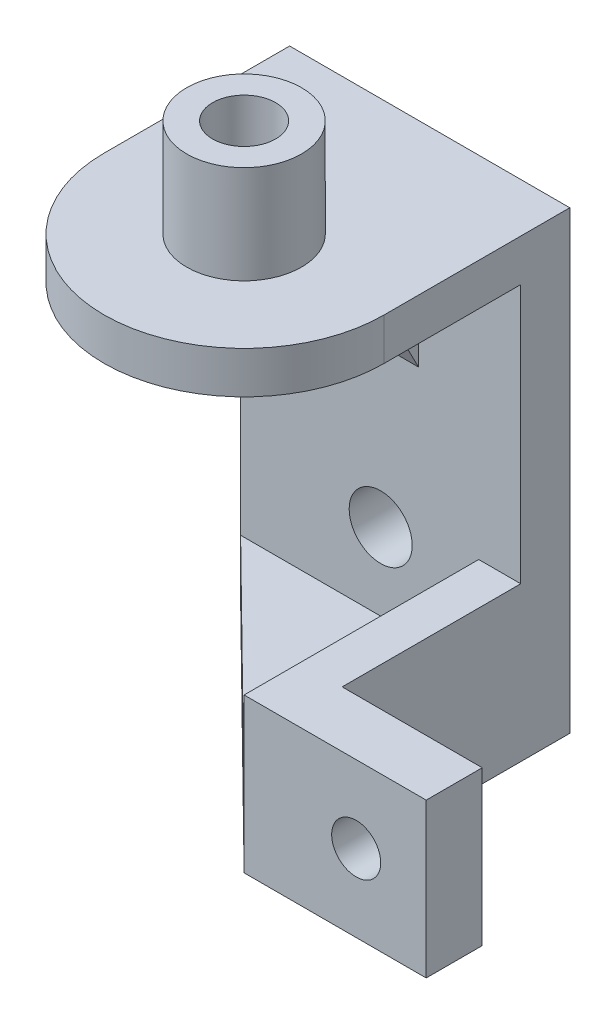
ISO-10303-21;
HEADER;
FILE_DESCRIPTION(('STEP AP214'),'2;1');
FILE_NAME('part.step','',(''),(''),'','','');
FILE_SCHEMA(('AUTOMOTIVE_DESIGN { 1 0 10303 214 1 1 1 1 }'));
ENDSEC;
DATA;
#1=APPLICATION_CONTEXT('core data for automotive mechanical design processes');
#2=APPLICATION_PROTOCOL_DEFINITION('international standard','automotive_design',2000,#1);
#3=PRODUCT_CONTEXT('',#1,'mechanical');
#4=PRODUCT('Part','Part','',(#3));
#5=PRODUCT_RELATED_PRODUCT_CATEGORY('part','',(#4));
#6=PRODUCT_DEFINITION_FORMATION('','',#4);
#7=PRODUCT_DEFINITION_CONTEXT('part definition',#1,'design');
#8=PRODUCT_DEFINITION('design','',#6,#7);
#9=PRODUCT_DEFINITION_SHAPE('','',#8);
#10=(LENGTH_UNIT() NAMED_UNIT(*) SI_UNIT(.MILLI.,.METRE.));
#11=(NAMED_UNIT(*) PLANE_ANGLE_UNIT() SI_UNIT($,.RADIAN.));
#12=(NAMED_UNIT(*) SI_UNIT($,.STERADIAN.) SOLID_ANGLE_UNIT());
#13=UNCERTAINTY_MEASURE_WITH_UNIT(LENGTH_MEASURE(1.E-05),#10,'distance_accuracy_value','');
#14=(GEOMETRIC_REPRESENTATION_CONTEXT(3) GLOBAL_UNCERTAINTY_ASSIGNED_CONTEXT((#13)) GLOBAL_UNIT_ASSIGNED_CONTEXT((#10,
#11,#12)) REPRESENTATION_CONTEXT('',''));
#15=CARTESIAN_POINT('',(0.,0.,0.));
#16=DIRECTION('',(0.,0.,1.));
#17=DIRECTION('',(1.,0.,0.));
#18=AXIS2_PLACEMENT_3D('',#15,#16,#17);
#19=CARTESIAN_POINT('',(1.28402573287201,-48.,-15.9459750219353));
#20=DIRECTION('',(0.,0.,-1.));
#21=DIRECTION('',(-1.,0.,0.));
#22=AXIS2_PLACEMENT_3D('',#19,#20,#21);
#23=PLANE('',#22);
#24=CARTESIAN_POINT('',(-8.71597426712799,-43.,-15.9459750219353));
#25=DIRECTION('',(0.,0.,1.));
#26=DIRECTION('',(-1.,0.,0.));
#27=AXIS2_PLACEMENT_3D('',#24,#25,#26);
#28=CIRCLE('',#27,2.25);
#29=CARTESIAN_POINT('',(-10.965974267128,-43.,-15.9459750219353));
#30=VERTEX_POINT('',#29);
#31=EDGE_CURVE('E303',#30,#30,#28,.T.);
#32=ORIENTED_EDGE('',*,*,#31,.F.);
#33=EDGE_LOOP('',(#32));
#34=FACE_BOUND('',#33,.T.);
#35=DIRECTION('',(1.,0.,0.));
#36=VECTOR('',#35,1.);
#37=CARTESIAN_POINT('',(1.28402573287201,-48.5,-15.9459750219353));
#38=LINE('',#37,#36);
#39=CARTESIAN_POINT('',(-18.715974267128,-48.5,-15.9459750219353));
#40=VERTEX_POINT('',#39);
#41=CARTESIAN_POINT('',(-1.71597426712799,-48.5,-15.9459750219353));
#42=VERTEX_POINT('',#41);
#43=EDGE_CURVE('E193',#40,#42,#38,.T.);
#44=ORIENTED_EDGE('',*,*,#43,.T.);
#45=DIRECTION('',(0.,1.,0.));
#46=VECTOR('',#45,1.);
#47=CARTESIAN_POINT('',(-1.71597426712799,-52.5,-15.9459750219353));
#48=LINE('',#47,#46);
#49=CARTESIAN_POINT('',(-1.71597426712799,-41.5,-15.9459750219353));
#50=VERTEX_POINT('',#49);
#51=EDGE_CURVE('E237',#42,#50,#48,.T.);
#52=ORIENTED_EDGE('',*,*,#51,.T.);
#53=DIRECTION('',(1.,0.,0.));
#54=VECTOR('',#53,1.);
#55=CARTESIAN_POINT('',(1.28402573287201,-41.5,-15.9459750219353));
#56=LINE('',#55,#54);
#57=CARTESIAN_POINT('',(1.28402573287201,-41.5,-15.9459750219353));
#58=VERTEX_POINT('',#57);
#59=EDGE_CURVE('E243',#50,#58,#56,.T.);
#60=ORIENTED_EDGE('',*,*,#59,.T.);
#61=DIRECTION('',(0.,1.,0.));
#62=VECTOR('',#61,1.);
#63=CARTESIAN_POINT('',(1.28402573287201,-48.,-15.9459750219353));
#64=LINE('',#63,#62);
#65=CARTESIAN_POINT('',(1.28402573287201,-23.,-15.9459750219353));
#66=VERTEX_POINT('',#65);
#67=EDGE_CURVE('E198',#58,#66,#64,.T.);
#68=ORIENTED_EDGE('',*,*,#67,.T.);
#69=DIRECTION('',(1.,0.,0.));
#70=VECTOR('',#69,1.);
#71=CARTESIAN_POINT('',(1.28402573287201,-23.,-15.9459750219353));
#72=LINE('',#71,#70);
#73=CARTESIAN_POINT('',(-6.01597426712799,-23.,-15.9459750219353));
#74=VERTEX_POINT('',#73);
#75=EDGE_CURVE('E312',#74,#66,#72,.T.);
#76=ORIENTED_EDGE('',*,*,#75,.F.);
#77=DIRECTION('',(0.,-1.,0.));
#78=VECTOR('',#77,1.);
#79=CARTESIAN_POINT('',(-6.01597426712799,-48.,-15.9459750219353));
#80=LINE('',#79,#78);
#81=CARTESIAN_POINT('',(-6.01597426712799,-31.75,-15.9459750219353));
#82=VERTEX_POINT('',#81);
#83=EDGE_CURVE('E273',#74,#82,#80,.T.);
#84=ORIENTED_EDGE('',*,*,#83,.T.);
#85=DIRECTION('',(-1.,0.,0.));
#86=VECTOR('',#85,1.);
#87=CARTESIAN_POINT('',(1.28402573287201,-31.75,-15.9459750219353));
#88=LINE('',#87,#86);
#89=CARTESIAN_POINT('',(-11.415974267128,-31.75,-15.9459750219353));
#90=VERTEX_POINT('',#89);
#91=EDGE_CURVE('E291',#90,#82,#88,.F.);
#92=ORIENTED_EDGE('',*,*,#91,.F.);
#93=DIRECTION('',(0.,-1.,0.));
#94=VECTOR('',#93,1.);
#95=CARTESIAN_POINT('',(-11.415974267128,-48.,-15.9459750219353));
#96=LINE('',#95,#94);
#97=CARTESIAN_POINT('',(-11.415974267128,-23.,-15.9459750219353));
#98=VERTEX_POINT('',#97);
#99=EDGE_CURVE('E283',#98,#90,#96,.T.);
#100=ORIENTED_EDGE('',*,*,#99,.F.);
#101=CARTESIAN_POINT('',(-18.715974267128,-23.,-15.9459750219353));
#102=VERTEX_POINT('',#101);
#103=EDGE_CURVE('E196',#102,#98,#72,.T.);
#104=ORIENTED_EDGE('',*,*,#103,.F.);
#105=DIRECTION('',(0.,1.,0.));
#106=VECTOR('',#105,1.);
#107=CARTESIAN_POINT('',(-18.715974267128,-48.,-15.9459750219353));
#108=LINE('',#107,#106);
#109=EDGE_CURVE('E183',#40,#102,#108,.T.);
#110=ORIENTED_EDGE('',*,*,#109,.F.);
#111=EDGE_LOOP('',(#44,#52,#60,#68,#76,#84,#92,#100,#104,#110));
#112=FACE_BOUND('',#111,.T.);
#113=ADVANCED_FACE('F57',(#34,#112),#23,.F.);
#114=CARTESIAN_POINT('',(-1.71597426712799,-52.5,0.804024978064668));
#115=DIRECTION('',(1.,0.,0.));
#116=DIRECTION('',(0.,-1.,0.));
#117=AXIS2_PLACEMENT_3D('',#114,#115,#116);
#118=PLANE('',#117);
#119=DIRECTION('',(0.,0.,1.));
#120=VECTOR('',#119,1.);
#121=CARTESIAN_POINT('',(-1.71597426712799,-48.5,0.804024978064668));
#122=LINE('',#121,#120);
#123=CARTESIAN_POINT('',(-1.71597426712799,-48.5,0.804024978064668));
#124=VERTEX_POINT('',#123);
#125=EDGE_CURVE('E201',#42,#124,#122,.T.);
#126=ORIENTED_EDGE('',*,*,#125,.T.);
#127=DIRECTION('',(0.,1.,0.));
#128=VECTOR('',#127,1.);
#129=CARTESIAN_POINT('',(-1.71597426712799,-52.5,0.804024978064668));
#130=LINE('',#129,#128);
#131=CARTESIAN_POINT('',(-1.71597426712799,-41.5,0.804024978064668));
#132=VERTEX_POINT('',#131);
#133=EDGE_CURVE('E242',#124,#132,#130,.T.);
#134=ORIENTED_EDGE('',*,*,#133,.T.);
#135=DIRECTION('',(0.,0.,-1.));
#136=VECTOR('',#135,1.);
#137=CARTESIAN_POINT('',(-1.71597426712799,-41.5,0.804024978064668));
#138=LINE('',#137,#136);
#139=EDGE_CURVE('E83',#132,#50,#138,.T.);
#140=ORIENTED_EDGE('',*,*,#139,.T.);
#141=ORIENTED_EDGE('',*,*,#51,.F.);
#142=EDGE_LOOP('',(#126,#134,#140,#141));
#143=FACE_BOUND('',#142,.T.);
#144=ADVANCED_FACE('F365',(#143),#118,.F.);
#145=CARTESIAN_POINT('',(1.28402573287201,-23.,0.));
#146=DIRECTION('',(1.,0.,0.));
#147=DIRECTION('',(0.,0.,-1.));
#148=AXIS2_PLACEMENT_3D('',#145,#146,#147);
#149=PLANE('',#148);
#150=DIRECTION('',(0.,0.,1.));
#151=VECTOR('',#150,1.);
#152=CARTESIAN_POINT('',(1.28402573287201,-52.5,-19.4459750219353));
#153=LINE('',#152,#151);
#154=CARTESIAN_POINT('',(1.28402573287201,-52.5,-19.4459750219353));
#155=VERTEX_POINT('',#154);
#156=CARTESIAN_POINT('',(1.28402573287201,-52.5,-3.19597502193533));
#157=VERTEX_POINT('',#156);
#158=EDGE_CURVE('E263',#155,#157,#153,.T.);
#159=ORIENTED_EDGE('',*,*,#158,.F.);
#160=DIRECTION('',(0.,1.,0.));
#161=VECTOR('',#160,1.);
#162=CARTESIAN_POINT('',(1.28402573287201,-23.,-19.4459750219353));
#163=LINE('',#162,#161);
#164=CARTESIAN_POINT('',(1.28402573287201,-20.,-19.4459750219353));
#165=VERTEX_POINT('',#164);
#166=EDGE_CURVE('E349',#155,#165,#163,.T.);
#167=ORIENTED_EDGE('',*,*,#166,.T.);
#168=DIRECTION('',(0.,0.,1.));
#169=VECTOR('',#168,1.);
#170=CARTESIAN_POINT('',(1.28402573287201,-20.,0.));
#171=LINE('',#170,#169);
#172=CARTESIAN_POINT('',(1.28402573287201,-20.,-6.19597502193533));
#173=VERTEX_POINT('',#172);
#174=EDGE_CURVE('E341',#165,#173,#171,.T.);
#175=ORIENTED_EDGE('',*,*,#174,.T.);
#176=DIRECTION('',(0.,1.,0.));
#177=VECTOR('',#176,1.);
#178=CARTESIAN_POINT('',(1.28402573287201,-23.,-6.19597502193533));
#179=LINE('',#178,#177);
#180=CARTESIAN_POINT('',(1.28402573287201,-23.,-6.19597502193533));
#181=VERTEX_POINT('',#180);
#182=EDGE_CURVE('E353',#181,#173,#179,.T.);
#183=ORIENTED_EDGE('',*,*,#182,.F.);
#184=DIRECTION('',(0.,0.,1.));
#185=VECTOR('',#184,1.);
#186=CARTESIAN_POINT('',(1.28402573287201,-23.,0.));
#187=LINE('',#186,#185);
#188=EDGE_CURVE('E329',#66,#181,#187,.T.);
#189=ORIENTED_EDGE('',*,*,#188,.F.);
#190=ORIENTED_EDGE('',*,*,#67,.F.);
#191=DIRECTION('',(0.,0.,-1.));
#192=VECTOR('',#191,1.);
#193=CARTESIAN_POINT('',(1.28402573287201,-41.5,0.804024978064668));
#194=LINE('',#193,#192);
#195=CARTESIAN_POINT('',(1.28402573287201,-41.5,-3.19597502193533));
#196=VERTEX_POINT('',#195);
#197=EDGE_CURVE('E250',#196,#58,#194,.T.);
#198=ORIENTED_EDGE('',*,*,#197,.F.);
#199=DIRECTION('',(0.,-1.,0.));
#200=VECTOR('',#199,1.);
#201=CARTESIAN_POINT('',(1.28402573287201,-41.5,-3.19597502193533));
#202=LINE('',#201,#200);
#203=EDGE_CURVE('E213',#196,#157,#202,.T.);
#204=ORIENTED_EDGE('',*,*,#203,.T.);
#205=EDGE_LOOP('',(#159,#167,#175,#183,#189,#190,#198,#204));
#206=FACE_BOUND('',#205,.T.);
#207=ADVANCED_FACE('F370',(#206),#149,.T.);
#208=CARTESIAN_POINT('',(0.,-20.,0.));
#209=DIRECTION('',(0.,-1.,0.));
#210=DIRECTION('',(0.,0.,1.));
#211=AXIS2_PLACEMENT_3D('',#208,#209,#210);
#212=PLANE('',#211);
#213=CARTESIAN_POINT('',(-8.71597426712799,-20.,-6.19597502193533));
#214=DIRECTION('',(0.,1.,0.));
#215=DIRECTION('',(0.,0.,1.));
#216=AXIS2_PLACEMENT_3D('',#213,#214,#215);
#217=CIRCLE('',#216,4.1);
#218=CARTESIAN_POINT('',(-8.71597426712799,-20.,-2.09597502193533));
#219=VERTEX_POINT('',#218);
#220=EDGE_CURVE('E12',#219,#219,#217,.F.);
#221=ORIENTED_EDGE('',*,*,#220,.T.);
#222=EDGE_LOOP('',(#221));
#223=FACE_BOUND('',#222,.T.);
#224=DIRECTION('',(1.,0.,0.));
#225=VECTOR('',#224,1.);
#226=CARTESIAN_POINT('',(0.,-20.,-19.4459750219353));
#227=LINE('',#226,#225);
#228=CARTESIAN_POINT('',(-18.715974267128,-20.,-19.4459750219353));
#229=VERTEX_POINT('',#228);
#230=EDGE_CURVE('E326',#229,#165,#227,.T.);
#231=ORIENTED_EDGE('',*,*,#230,.F.);
#232=DIRECTION('',(0.,0.,1.));
#233=VECTOR('',#232,1.);
#234=CARTESIAN_POINT('',(-18.715974267128,-20.,0.));
#235=LINE('',#234,#233);
#236=CARTESIAN_POINT('',(-18.715974267128,-20.,-6.19597502193533));
#237=VERTEX_POINT('',#236);
#238=EDGE_CURVE('E321',#229,#237,#235,.T.);
#239=ORIENTED_EDGE('',*,*,#238,.T.);
#240=CARTESIAN_POINT('',(-8.71597426712799,-20.,-6.19597502193533));
#241=DIRECTION('',(0.,1.,0.));
#242=DIRECTION('',(0.,0.,1.));
#243=AXIS2_PLACEMENT_3D('',#240,#241,#242);
#244=CIRCLE('',#243,10.);
#245=EDGE_CURVE('E337',#173,#237,#244,.F.);
#246=ORIENTED_EDGE('',*,*,#245,.F.);
#247=ORIENTED_EDGE('',*,*,#174,.F.);
#248=EDGE_LOOP('',(#231,#239,#246,#247));
#249=FACE_BOUND('',#248,.T.);
#250=ADVANCED_FACE('F386',(#223,#249),#212,.F.);
#251=CARTESIAN_POINT('',(-18.715974267128,-23.,0.));
#252=DIRECTION('',(1.,0.,0.));
#253=DIRECTION('',(0.,0.,-1.));
#254=AXIS2_PLACEMENT_3D('',#251,#252,#253);
#255=PLANE('',#254);
#256=DIRECTION('',(0.,1.,0.));
#257=VECTOR('',#256,1.);
#258=CARTESIAN_POINT('',(-18.715974267128,-23.,-19.4459750219353));
#259=LINE('',#258,#257);
#260=CARTESIAN_POINT('',(-18.715974267128,-52.5,-19.4459750219353));
#261=VERTEX_POINT('',#260);
#262=EDGE_CURVE('E333',#261,#229,#259,.T.);
#263=ORIENTED_EDGE('',*,*,#262,.F.);
#264=DIRECTION('',(0.,0.,1.));
#265=VECTOR('',#264,1.);
#266=CARTESIAN_POINT('',(-18.715974267128,-52.5,-19.4459750219353));
#267=LINE('',#266,#265);
#268=CARTESIAN_POINT('',(-18.715974267128,-52.5,-15.9459750219353));
#269=VERTEX_POINT('',#268);
#270=EDGE_CURVE('E186',#261,#269,#267,.T.);
#271=ORIENTED_EDGE('',*,*,#270,.T.);
#272=EDGE_CURVE('E171',#269,#40,#108,.T.);
#273=ORIENTED_EDGE('',*,*,#272,.T.);
#274=ORIENTED_EDGE('',*,*,#109,.T.);
#275=DIRECTION('',(0.,0.,1.));
#276=VECTOR('',#275,1.);
#277=CARTESIAN_POINT('',(-18.715974267128,-23.,0.));
#278=LINE('',#277,#276);
#279=CARTESIAN_POINT('',(-18.715974267128,-23.,-6.19597502193533));
#280=VERTEX_POINT('',#279);
#281=EDGE_CURVE('E322',#102,#280,#278,.T.);
#282=ORIENTED_EDGE('',*,*,#281,.T.);
#283=DIRECTION('',(0.,1.,0.));
#284=VECTOR('',#283,1.);
#285=CARTESIAN_POINT('',(-18.715974267128,-23.,-6.19597502193533));
#286=LINE('',#285,#284);
#287=EDGE_CURVE('E67',#280,#237,#286,.T.);
#288=ORIENTED_EDGE('',*,*,#287,.T.);
#289=ORIENTED_EDGE('',*,*,#238,.F.);
#290=EDGE_LOOP('',(#263,#271,#273,#274,#282,#288,#289));
#291=FACE_BOUND('',#290,.T.);
#292=ADVANCED_FACE('F59',(#291),#255,.F.);
#293=CARTESIAN_POINT('',(-8.71597426712799,-23.,-6.19597502193533));
#294=DIRECTION('',(0.,1.,0.));
#295=DIRECTION('',(0.,0.,-1.));
#296=AXIS2_PLACEMENT_3D('',#293,#294,#295);
#297=CYLINDRICAL_SURFACE('',#296,10.);
#298=ORIENTED_EDGE('',*,*,#245,.T.);
#299=ORIENTED_EDGE('',*,*,#287,.F.);
#300=CARTESIAN_POINT('',(-8.71597426712799,-23.,-6.19597502193533));
#301=DIRECTION('',(0.,1.,0.));
#302=DIRECTION('',(0.,0.,1.));
#303=AXIS2_PLACEMENT_3D('',#300,#301,#302);
#304=CIRCLE('',#303,10.);
#305=EDGE_CURVE('E325',#181,#280,#304,.F.);
#306=ORIENTED_EDGE('',*,*,#305,.F.);
#307=ORIENTED_EDGE('',*,*,#182,.T.);
#308=EDGE_LOOP('',(#298,#299,#306,#307));
#309=FACE_BOUND('',#308,.T.);
#310=ADVANCED_FACE('F392',(#309),#297,.T.);
#311=CARTESIAN_POINT('',(0.,-23.,-19.4459750219353));
#312=DIRECTION('',(0.,0.,-1.));
#313=DIRECTION('',(-1.,0.,0.));
#314=AXIS2_PLACEMENT_3D('',#311,#312,#313);
#315=PLANE('',#314);
#316=ORIENTED_EDGE('',*,*,#166,.F.);
#317=DIRECTION('',(-1.,0.,0.));
#318=VECTOR('',#317,1.);
#319=CARTESIAN_POINT('',(-18.715974267128,-52.5,-19.4459750219353));
#320=LINE('',#319,#318);
#321=EDGE_CURVE('E260',#155,#261,#320,.T.);
#322=ORIENTED_EDGE('',*,*,#321,.T.);
#323=ORIENTED_EDGE('',*,*,#262,.T.);
#324=ORIENTED_EDGE('',*,*,#230,.T.);
#325=EDGE_LOOP('',(#316,#322,#323,#324));
#326=FACE_BOUND('',#325,.T.);
#327=CARTESIAN_POINT('',(-8.71597426712799,-43.,-19.4459750219353));
#328=DIRECTION('',(0.,0.,1.));
#329=DIRECTION('',(-1.,0.,0.));
#330=AXIS2_PLACEMENT_3D('',#327,#328,#329);
#331=CIRCLE('',#330,2.25);
#332=CARTESIAN_POINT('',(-10.965974267128,-43.,-19.4459750219353));
#333=VERTEX_POINT('',#332);
#334=EDGE_CURVE('E299',#333,#333,#331,.T.);
#335=ORIENTED_EDGE('',*,*,#334,.T.);
#336=EDGE_LOOP('',(#335));
#337=FACE_BOUND('',#336,.T.);
#338=ADVANCED_FACE('F384',(#326,#337),#315,.T.);
#339=CARTESIAN_POINT('',(0.,-23.,0.));
#340=DIRECTION('',(0.,-1.,0.));
#341=DIRECTION('',(0.,0.,1.));
#342=AXIS2_PLACEMENT_3D('',#339,#340,#341);
#343=PLANE('',#342);
#344=DIRECTION('',(0.,0.,1.));
#345=VECTOR('',#344,1.);
#346=CARTESIAN_POINT('',(-11.415974267128,-23.,0.));
#347=LINE('',#346,#345);
#348=CARTESIAN_POINT('',(-11.415974267128,-23.,-11.4459750219353));
#349=VERTEX_POINT('',#348);
#350=EDGE_CURVE('E287',#98,#349,#347,.T.);
#351=ORIENTED_EDGE('',*,*,#350,.T.);
#352=DIRECTION('',(-1.,0.,0.));
#353=VECTOR('',#352,1.);
#354=CARTESIAN_POINT('',(0.,-23.,-11.4459750219353));
#355=LINE('',#354,#353);
#356=CARTESIAN_POINT('',(-6.01597426712799,-23.,-11.4459750219353));
#357=VERTEX_POINT('',#356);
#358=EDGE_CURVE('E295',#349,#357,#355,.F.);
#359=ORIENTED_EDGE('',*,*,#358,.T.);
#360=DIRECTION('',(0.,0.,1.));
#361=VECTOR('',#360,1.);
#362=CARTESIAN_POINT('',(-6.01597426712799,-23.,0.));
#363=LINE('',#362,#361);
#364=EDGE_CURVE('E279',#74,#357,#363,.T.);
#365=ORIENTED_EDGE('',*,*,#364,.F.);
#366=ORIENTED_EDGE('',*,*,#75,.T.);
#367=ORIENTED_EDGE('',*,*,#188,.T.);
#368=ORIENTED_EDGE('',*,*,#305,.T.);
#369=ORIENTED_EDGE('',*,*,#281,.F.);
#370=ORIENTED_EDGE('',*,*,#103,.T.);
#371=EDGE_LOOP('',(#351,#359,#365,#366,#367,#368,#369,#370));
#372=FACE_BOUND('',#371,.T.);
#373=CARTESIAN_POINT('',(-8.71597426712799,-23.,-6.19597502193533));
#374=DIRECTION('',(0.,1.,0.));
#375=DIRECTION('',(0.,0.,1.));
#376=AXIS2_PLACEMENT_3D('',#373,#374,#375);
#377=CIRCLE('',#376,2.25);
#378=CARTESIAN_POINT('',(-8.71597426712799,-23.,-3.94597502193533));
#379=VERTEX_POINT('',#378);
#380=EDGE_CURVE('E188',#379,#379,#377,.T.);
#381=ORIENTED_EDGE('',*,*,#380,.T.);
#382=EDGE_LOOP('',(#381));
#383=FACE_BOUND('',#382,.T.);
#384=ADVANCED_FACE('F380',(#372,#383),#343,.T.);
#385=CARTESIAN_POINT('',(-8.71597426712799,-20.,-6.19597502193533));
#386=DIRECTION('',(0.,-1.,0.));
#387=DIRECTION('',(0.,0.,1.));
#388=AXIS2_PLACEMENT_3D('',#385,#386,#387);
#389=CYLINDRICAL_SURFACE('',#388,2.25);
#390=ORIENTED_EDGE('',*,*,#380,.F.);
#391=EDGE_LOOP('',(#390));
#392=FACE_BOUND('',#391,.T.);
#393=CARTESIAN_POINT('',(-8.71597426712799,-13.,-6.19597502193533));
#394=DIRECTION('',(0.,-1.,0.));
#395=DIRECTION('',(0.,0.,-1.));
#396=AXIS2_PLACEMENT_3D('',#393,#394,#395);
#397=CIRCLE('',#396,2.25);
#398=CARTESIAN_POINT('',(-8.71597426712799,-13.,-8.44597502193533));
#399=VERTEX_POINT('',#398);
#400=EDGE_CURVE('E304',#399,#399,#397,.T.);
#401=ORIENTED_EDGE('',*,*,#400,.F.);
#402=EDGE_LOOP('',(#401));
#403=FACE_BOUND('',#402,.T.);
#404=ADVANCED_FACE('F376',(#392,#403),#389,.F.);
#405=CARTESIAN_POINT('',(-8.71597426712799,-13.,-6.19597502193533));
#406=DIRECTION('',(0.,1.,0.));
#407=DIRECTION('',(0.,0.,-1.));
#408=AXIS2_PLACEMENT_3D('',#405,#406,#407);
#409=PLANE('',#408);
#410=ORIENTED_EDGE('',*,*,#400,.T.);
#411=EDGE_LOOP('',(#410));
#412=FACE_BOUND('',#411,.T.);
#413=CARTESIAN_POINT('',(-8.71597426712799,-13.,-6.19597502193533));
#414=DIRECTION('',(0.,-1.,0.));
#415=DIRECTION('',(0.,0.,-1.));
#416=AXIS2_PLACEMENT_3D('',#413,#414,#415);
#417=CIRCLE('',#416,4.1);
#418=CARTESIAN_POINT('',(-8.71597426712799,-13.,-10.2959750219353));
#419=VERTEX_POINT('',#418);
#420=EDGE_CURVE('E308',#419,#419,#417,.T.);
#421=ORIENTED_EDGE('',*,*,#420,.F.);
#422=EDGE_LOOP('',(#421));
#423=FACE_BOUND('',#422,.T.);
#424=ADVANCED_FACE('F379',(#412,#423),#409,.T.);
#425=CARTESIAN_POINT('',(-8.71597426712799,-13.,-6.19597502193533));
#426=DIRECTION('',(0.,-1.,0.));
#427=DIRECTION('',(0.,0.,1.));
#428=AXIS2_PLACEMENT_3D('',#425,#426,#427);
#429=CYLINDRICAL_SURFACE('',#428,4.1);
#430=ORIENTED_EDGE('',*,*,#220,.F.);
#431=EDGE_LOOP('',(#430));
#432=FACE_BOUND('',#431,.T.);
#433=ORIENTED_EDGE('',*,*,#420,.T.);
#434=EDGE_LOOP('',(#433));
#435=FACE_BOUND('',#434,.T.);
#436=ADVANCED_FACE('F374',(#432,#435),#429,.T.);
#437=CARTESIAN_POINT('',(-8.71597426712799,-43.,3.55402497806468));
#438=DIRECTION('',(0.,0.,-1.));
#439=DIRECTION('',(-1.,0.,0.));
#440=AXIS2_PLACEMENT_3D('',#437,#438,#439);
#441=CYLINDRICAL_SURFACE('',#440,2.25);
#442=ORIENTED_EDGE('',*,*,#334,.F.);
#443=EDGE_LOOP('',(#442));
#444=FACE_BOUND('',#443,.T.);
#445=ORIENTED_EDGE('',*,*,#31,.T.);
#446=EDGE_LOOP('',(#445));
#447=FACE_BOUND('',#446,.T.);
#448=ADVANCED_FACE('F362',(#444,#447),#441,.F.);
#449=CARTESIAN_POINT('',(-8.715974267128,-31.75,-15.9459750219353));
#450=DIRECTION('',(0.,0.457348012620761,-0.889287802318147));
#451=DIRECTION('',(0.,0.889287802318147,0.457348012620761));
#452=AXIS2_PLACEMENT_3D('',#449,#450,#451);
#453=PLANE('',#452);
#454=DIRECTION('',(0.,0.889287802318147,0.457348012620761));
#455=VECTOR('',#454,1.);
#456=CARTESIAN_POINT('',(-11.415974267128,-31.75,-15.9459750219353));
#457=LINE('',#456,#455);
#458=EDGE_CURVE('E270',#90,#349,#457,.T.);
#459=ORIENTED_EDGE('',*,*,#458,.F.);
#460=ORIENTED_EDGE('',*,*,#91,.T.);
#461=DIRECTION('',(0.,0.889287802318147,0.457348012620761));
#462=VECTOR('',#461,1.);
#463=CARTESIAN_POINT('',(-6.01597426712799,-31.75,-15.9459750219353));
#464=LINE('',#463,#462);
#465=EDGE_CURVE('E266',#82,#357,#464,.T.);
#466=ORIENTED_EDGE('',*,*,#465,.T.);
#467=ORIENTED_EDGE('',*,*,#358,.F.);
#468=EDGE_LOOP('',(#459,#460,#466,#467));
#469=FACE_BOUND('',#468,.T.);
#470=ADVANCED_FACE('F458',(#469),#453,.F.);
#471=CARTESIAN_POINT('',(-11.415974267128,-30.5,-7.82097502193533));
#472=DIRECTION('',(-1.,0.,0.));
#473=DIRECTION('',(0.,0.,1.));
#474=AXIS2_PLACEMENT_3D('',#471,#472,#473);
#475=PLANE('',#474);
#476=ORIENTED_EDGE('',*,*,#458,.T.);
#477=ORIENTED_EDGE('',*,*,#350,.F.);
#478=ORIENTED_EDGE('',*,*,#99,.T.);
#479=EDGE_LOOP('',(#476,#477,#478));
#480=FACE_BOUND('',#479,.T.);
#481=ADVANCED_FACE('F455',(#480),#475,.T.);
#482=CARTESIAN_POINT('',(-6.01597426712799,-30.5,-7.82097502193533));
#483=DIRECTION('',(-1.,0.,0.));
#484=DIRECTION('',(0.,0.,1.));
#485=AXIS2_PLACEMENT_3D('',#482,#483,#484);
#486=PLANE('',#485);
#487=ORIENTED_EDGE('',*,*,#364,.T.);
#488=ORIENTED_EDGE('',*,*,#465,.F.);
#489=ORIENTED_EDGE('',*,*,#83,.F.);
#490=EDGE_LOOP('',(#487,#488,#489));
#491=FACE_BOUND('',#490,.T.);
#492=ADVANCED_FACE('F454',(#491),#486,.F.);
#493=CARTESIAN_POINT('',(-18.715974267128,-52.5,-19.4459750219353));
#494=DIRECTION('',(0.,-1.,0.));
#495=DIRECTION('',(0.,0.,1.));
#496=AXIS2_PLACEMENT_3D('',#493,#494,#495);
#497=PLANE('',#496);
#498=ORIENTED_EDGE('',*,*,#270,.F.);
#499=ORIENTED_EDGE('',*,*,#321,.F.);
#500=ORIENTED_EDGE('',*,*,#158,.T.);
#501=DIRECTION('',(-1.,0.,0.));
#502=VECTOR('',#501,1.);
#503=CARTESIAN_POINT('',(11.284025732872,-52.5,-3.19597502193533));
#504=LINE('',#503,#502);
#505=CARTESIAN_POINT('',(11.284025732872,-52.5,-3.19597502193533));
#506=VERTEX_POINT('',#505);
#507=EDGE_CURVE('E228',#506,#157,#504,.T.);
#508=ORIENTED_EDGE('',*,*,#507,.F.);
#509=DIRECTION('',(0.,0.,1.));
#510=VECTOR('',#509,1.);
#511=CARTESIAN_POINT('',(11.284025732872,-52.5,0.804024978064667));
#512=LINE('',#511,#510);
#513=CARTESIAN_POINT('',(11.284025732872,-52.5,0.804024978064667));
#514=VERTEX_POINT('',#513);
#515=EDGE_CURVE('E224',#506,#514,#512,.T.);
#516=ORIENTED_EDGE('',*,*,#515,.T.);
#517=DIRECTION('',(-1.,0.,0.));
#518=VECTOR('',#517,1.);
#519=CARTESIAN_POINT('',(1.28402573287201,-52.5,0.804024978064668));
#520=LINE('',#519,#518);
#521=CARTESIAN_POINT('',(-1.71597426712799,-52.5,0.804024978064668));
#522=VERTEX_POINT('',#521);
#523=EDGE_CURVE('E238',#514,#522,#520,.T.);
#524=ORIENTED_EDGE('',*,*,#523,.T.);
#525=DIRECTION('',(-0.712325066937561,0.,-0.701849698306126));
#526=VECTOR('',#525,1.);
#527=CARTESIAN_POINT('',(-1.71597426712799,-52.5,0.804024978064668));
#528=LINE('',#527,#526);
#529=EDGE_CURVE('E176',#522,#269,#528,.T.);
#530=ORIENTED_EDGE('',*,*,#529,.T.);
#531=EDGE_LOOP('',(#498,#499,#500,#508,#516,#524,#530));
#532=FACE_BOUND('',#531,.T.);
#533=ADVANCED_FACE('F415',(#532),#497,.T.);
#534=CARTESIAN_POINT('',(1.28402573287201,-41.5,0.804024978064668));
#535=DIRECTION('',(0.,-1.,0.));
#536=DIRECTION('',(0.,0.,1.));
#537=AXIS2_PLACEMENT_3D('',#534,#535,#536);
#538=PLANE('',#537);
#539=ORIENTED_EDGE('',*,*,#59,.F.);
#540=ORIENTED_EDGE('',*,*,#139,.F.);
#541=DIRECTION('',(1.,0.,0.));
#542=VECTOR('',#541,1.);
#543=CARTESIAN_POINT('',(1.28402573287201,-41.5,0.804024978064668));
#544=LINE('',#543,#542);
#545=CARTESIAN_POINT('',(11.284025732872,-41.5,0.804024978064667));
#546=VERTEX_POINT('',#545);
#547=EDGE_CURVE('E246',#132,#546,#544,.T.);
#548=ORIENTED_EDGE('',*,*,#547,.T.);
#549=DIRECTION('',(0.,0.,-1.));
#550=VECTOR('',#549,1.);
#551=CARTESIAN_POINT('',(11.284025732872,-41.5,0.804024978064667));
#552=LINE('',#551,#550);
#553=CARTESIAN_POINT('',(11.284025732872,-41.5,-3.19597502193533));
#554=VERTEX_POINT('',#553);
#555=EDGE_CURVE('E217',#546,#554,#552,.T.);
#556=ORIENTED_EDGE('',*,*,#555,.T.);
#557=DIRECTION('',(-1.,0.,0.));
#558=VECTOR('',#557,1.);
#559=CARTESIAN_POINT('',(11.284025732872,-41.5,-3.19597502193533));
#560=LINE('',#559,#558);
#561=EDGE_CURVE('E234',#554,#196,#560,.T.);
#562=ORIENTED_EDGE('',*,*,#561,.T.);
#563=ORIENTED_EDGE('',*,*,#197,.T.);
#564=EDGE_LOOP('',(#539,#540,#548,#556,#562,#563));
#565=FACE_BOUND('',#564,.T.);
#566=ADVANCED_FACE('F426',(#565),#538,.F.);
#567=CARTESIAN_POINT('',(0.,-20.,0.804024978064668));
#568=DIRECTION('',(0.,0.,-1.));
#569=DIRECTION('',(-1.,0.,0.));
#570=AXIS2_PLACEMENT_3D('',#567,#568,#569);
#571=PLANE('',#570);
#572=CARTESIAN_POINT('',(6.28402573287201,-47.,0.804024978064668));
#573=DIRECTION('',(0.,0.,1.));
#574=DIRECTION('',(-1.,0.,0.));
#575=AXIS2_PLACEMENT_3D('',#572,#573,#574);
#576=CIRCLE('',#575,1.75);
#577=CARTESIAN_POINT('',(4.53402573287201,-47.,0.804024978064668));
#578=VERTEX_POINT('',#577);
#579=EDGE_CURVE('E207',#578,#578,#576,.F.);
#580=ORIENTED_EDGE('',*,*,#579,.T.);
#581=EDGE_LOOP('',(#580));
#582=FACE_BOUND('',#581,.T.);
#583=EDGE_CURVE('E173',#522,#124,#130,.T.);
#584=ORIENTED_EDGE('',*,*,#583,.F.);
#585=ORIENTED_EDGE('',*,*,#523,.F.);
#586=DIRECTION('',(0.,1.,0.));
#587=VECTOR('',#586,1.);
#588=CARTESIAN_POINT('',(11.284025732872,-41.5,0.804024978064667));
#589=LINE('',#588,#587);
#590=EDGE_CURVE('E214',#514,#546,#589,.T.);
#591=ORIENTED_EDGE('',*,*,#590,.T.);
#592=ORIENTED_EDGE('',*,*,#547,.F.);
#593=ORIENTED_EDGE('',*,*,#133,.F.);
#594=EDGE_LOOP('',(#584,#585,#591,#592,#593));
#595=FACE_BOUND('',#594,.T.);
#596=ADVANCED_FACE('F422',(#582,#595),#571,.F.);
#597=CARTESIAN_POINT('',(11.284025732872,-41.5,-3.19597502193533));
#598=DIRECTION('',(0.,0.,1.));
#599=DIRECTION('',(1.,0.,0.));
#600=AXIS2_PLACEMENT_3D('',#597,#598,#599);
#601=PLANE('',#600);
#602=CARTESIAN_POINT('',(6.28402573287201,-47.,-3.19597502193533));
#603=DIRECTION('',(0.,0.,-1.));
#604=DIRECTION('',(1.,0.,0.));
#605=AXIS2_PLACEMENT_3D('',#602,#603,#604);
#606=CIRCLE('',#605,1.75);
#607=CARTESIAN_POINT('',(8.03402573287201,-47.,-3.19597502193533));
#608=VERTEX_POINT('',#607);
#609=EDGE_CURVE('E61',#608,#608,#606,.F.);
#610=ORIENTED_EDGE('',*,*,#609,.T.);
#611=EDGE_LOOP('',(#610));
#612=FACE_BOUND('',#611,.T.);
#613=ORIENTED_EDGE('',*,*,#507,.T.);
#614=ORIENTED_EDGE('',*,*,#203,.F.);
#615=ORIENTED_EDGE('',*,*,#561,.F.);
#616=DIRECTION('',(0.,-1.,0.));
#617=VECTOR('',#616,1.);
#618=CARTESIAN_POINT('',(11.284025732872,-41.5,-3.19597502193533));
#619=LINE('',#618,#617);
#620=EDGE_CURVE('E221',#554,#506,#619,.T.);
#621=ORIENTED_EDGE('',*,*,#620,.T.);
#622=EDGE_LOOP('',(#613,#614,#615,#621));
#623=FACE_BOUND('',#622,.T.);
#624=ADVANCED_FACE('F431',(#612,#623),#601,.F.);
#625=CARTESIAN_POINT('',(11.284025732872,-20.,0.));
#626=DIRECTION('',(-1.,0.,0.));
#627=DIRECTION('',(0.,0.,1.));
#628=AXIS2_PLACEMENT_3D('',#625,#626,#627);
#629=PLANE('',#628);
#630=ORIENTED_EDGE('',*,*,#590,.F.);
#631=ORIENTED_EDGE('',*,*,#515,.F.);
#632=ORIENTED_EDGE('',*,*,#620,.F.);
#633=ORIENTED_EDGE('',*,*,#555,.F.);
#634=EDGE_LOOP('',(#630,#631,#632,#633));
#635=FACE_BOUND('',#634,.T.);
#636=ADVANCED_FACE('F433',(#635),#629,.F.);
#637=CARTESIAN_POINT('',(6.28402573287201,-47.,8.05402497806467));
#638=DIRECTION('',(0.,0.,-1.));
#639=DIRECTION('',(-1.,0.,0.));
#640=AXIS2_PLACEMENT_3D('',#637,#638,#639);
#641=CYLINDRICAL_SURFACE('',#640,1.75);
#642=ORIENTED_EDGE('',*,*,#609,.F.);
#643=EDGE_LOOP('',(#642));
#644=FACE_BOUND('',#643,.T.);
#645=ORIENTED_EDGE('',*,*,#579,.F.);
#646=EDGE_LOOP('',(#645));
#647=FACE_BOUND('',#646,.T.);
#648=ADVANCED_FACE('F435',(#644,#647),#641,.F.);
#649=CARTESIAN_POINT('',(-3.71597426712799,-48.5,-7.82097502193533));
#650=DIRECTION('',(0.,-1.,0.));
#651=DIRECTION('',(0.,0.,1.));
#652=AXIS2_PLACEMENT_3D('',#649,#650,#651);
#653=PLANE('',#652);
#654=DIRECTION('',(-0.712325066937561,0.,-0.701849698306126));
#655=VECTOR('',#654,1.);
#656=CARTESIAN_POINT('',(-1.71597426712799,-48.5,0.804024978064668));
#657=LINE('',#656,#655);
#658=EDGE_CURVE('E75',#124,#40,#657,.T.);
#659=ORIENTED_EDGE('',*,*,#658,.F.);
#660=ORIENTED_EDGE('',*,*,#125,.F.);
#661=ORIENTED_EDGE('',*,*,#43,.F.);
#662=EDGE_LOOP('',(#659,#660,#661));
#663=FACE_BOUND('',#662,.T.);
#664=ADVANCED_FACE('F199',(#663),#653,.F.);
#665=CARTESIAN_POINT('',(-1.71597426712799,-52.5,0.804024978064668));
#666=DIRECTION('',(0.701849698306126,0.,-0.712325066937561));
#667=DIRECTION('',(-0.712325066937561,0.,-0.701849698306126));
#668=AXIS2_PLACEMENT_3D('',#665,#666,#667);
#669=PLANE('',#668);
#670=ORIENTED_EDGE('',*,*,#529,.F.);
#671=ORIENTED_EDGE('',*,*,#583,.T.);
#672=ORIENTED_EDGE('',*,*,#658,.T.);
#673=ORIENTED_EDGE('',*,*,#272,.F.);
#674=EDGE_LOOP('',(#670,#671,#672,#673));
#675=FACE_BOUND('',#674,.T.);
#676=ADVANCED_FACE('F170',(#675),#669,.F.);
#677=CLOSED_SHELL('',(#113,#144,#207,#250,#292,#310,#338,#384,#404,#424,#436,#448,#470,#481,
#492,#533,#566,#596,#624,#636,#648,#664,#676));
#678=MANIFOLD_SOLID_BREP('B2',#677);
#679=ADVANCED_BREP_SHAPE_REPRESENTATION('',(#18,#678),#14);
#680=SHAPE_DEFINITION_REPRESENTATION(#9,#679);
ENDSEC;
END-ISO-10303-21;
